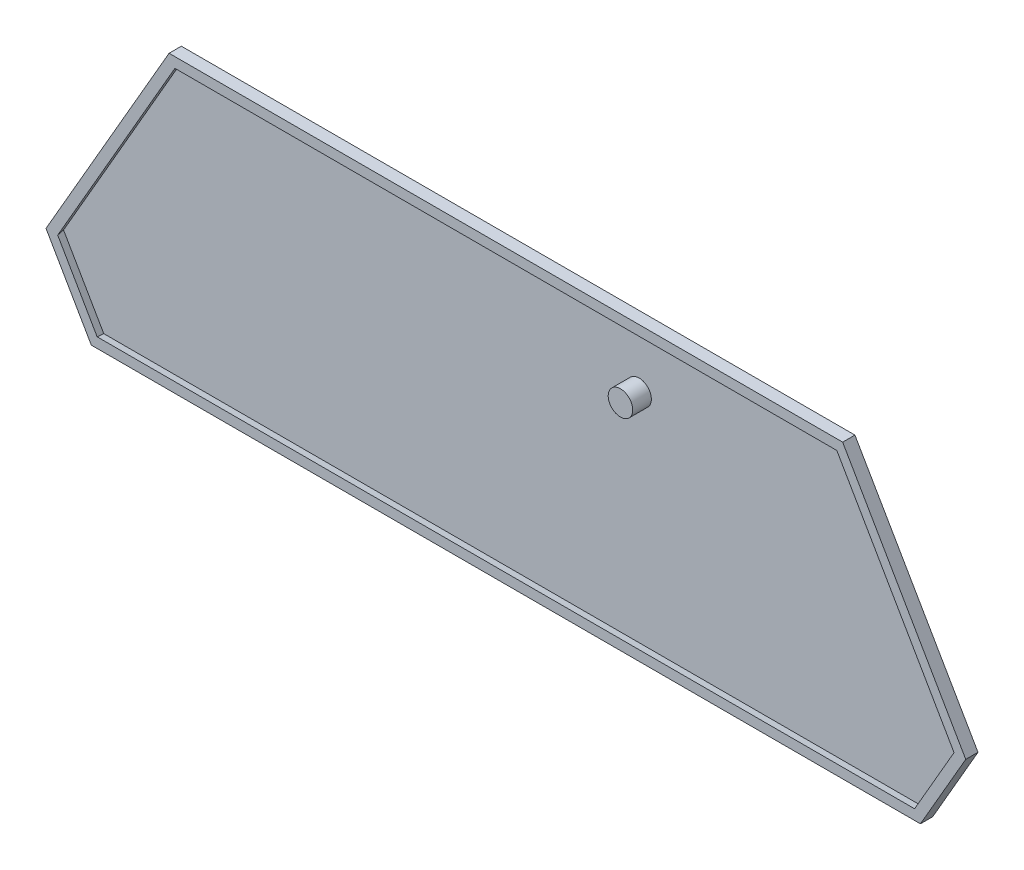
ISO-10303-21;
HEADER;
FILE_DESCRIPTION(('STEP AP214'),'2;1');
FILE_NAME('part.step','',(''),(''),'','','');
FILE_SCHEMA(('AUTOMOTIVE_DESIGN { 1 0 10303 214 1 1 1 1 }'));
ENDSEC;
DATA;
#1=APPLICATION_CONTEXT('core data for automotive mechanical design processes');
#2=APPLICATION_PROTOCOL_DEFINITION('international standard','automotive_design',2000,#1);
#3=PRODUCT_CONTEXT('',#1,'mechanical');
#4=PRODUCT('Part','Part','',(#3));
#5=PRODUCT_RELATED_PRODUCT_CATEGORY('part','',(#4));
#6=PRODUCT_DEFINITION_FORMATION('','',#4);
#7=PRODUCT_DEFINITION_CONTEXT('part definition',#1,'design');
#8=PRODUCT_DEFINITION('design','',#6,#7);
#9=PRODUCT_DEFINITION_SHAPE('','',#8);
#10=(LENGTH_UNIT() NAMED_UNIT(*) SI_UNIT(.MILLI.,.METRE.));
#11=(NAMED_UNIT(*) PLANE_ANGLE_UNIT() SI_UNIT($,.RADIAN.));
#12=(NAMED_UNIT(*) SI_UNIT($,.STERADIAN.) SOLID_ANGLE_UNIT());
#13=UNCERTAINTY_MEASURE_WITH_UNIT(LENGTH_MEASURE(1.E-05),#10,'distance_accuracy_value','');
#14=(GEOMETRIC_REPRESENTATION_CONTEXT(3) GLOBAL_UNCERTAINTY_ASSIGNED_CONTEXT((#13)) GLOBAL_UNIT_ASSIGNED_CONTEXT((#10,
#11,#12)) REPRESENTATION_CONTEXT('',''));
#15=CARTESIAN_POINT('',(0.,0.,0.));
#16=DIRECTION('',(0.,0.,1.));
#17=DIRECTION('',(1.,0.,0.));
#18=AXIS2_PLACEMENT_3D('',#15,#16,#17);
#19=CARTESIAN_POINT('',(0.,0.,2.5));
#20=DIRECTION('',(0.,0.,1.));
#21=DIRECTION('',(1.,0.,0.));
#22=AXIS2_PLACEMENT_3D('',#19,#20,#21);
#23=PLANE('',#22);
#24=DIRECTION('',(0.5,-0.866025403784439,0.));
#25=VECTOR('',#24,1.);
#26=CARTESIAN_POINT('',(-91.9744944991548,-42.4348324910002,2.5));
#27=LINE('',#26,#25);
#28=CARTESIAN_POINT('',(-91.378527434551,-43.4670777265315,2.5));
#29=VERTEX_POINT('',#28);
#30=CARTESIAN_POINT('',(-83.3328572567245,-57.4025872554689,2.5));
#31=VERTEX_POINT('',#30);
#32=EDGE_CURVE('E259',#29,#31,#27,.T.);
#33=ORIENTED_EDGE('',*,*,#32,.F.);
#34=DIRECTION('',(-0.5,-0.866025403784439,0.));
#35=VECTOR('',#34,1.);
#36=CARTESIAN_POINT('',(-66.8787654728554,-1.0322452355313,2.5));
#37=LINE('',#36,#35);
#38=CARTESIAN_POINT('',(-67.4747325374591,-2.06449047106265,2.5));
#39=VERTEX_POINT('',#38);
#40=EDGE_CURVE('E237',#39,#29,#37,.T.);
#41=ORIENTED_EDGE('',*,*,#40,.F.);
#42=DIRECTION('',(-1.,0.,0.));
#43=VECTOR('',#42,1.);
#44=CARTESIAN_POINT('',(68.6666666666666,-2.06449047106265,2.5));
#45=LINE('',#44,#43);
#46=CARTESIAN_POINT('',(67.4747325374592,-2.06449047106265,2.5));
#47=VERTEX_POINT('',#46);
#48=EDGE_CURVE('E242',#47,#39,#45,.T.);
#49=ORIENTED_EDGE('',*,*,#48,.F.);
#50=DIRECTION('',(-0.5,0.866025403784438,0.));
#51=VECTOR('',#50,1.);
#52=CARTESIAN_POINT('',(91.9744944991548,-44.4993229620628,2.5));
#53=LINE('',#52,#51);
#54=CARTESIAN_POINT('',(91.3785274345511,-43.4670777265315,2.5));
#55=VERTEX_POINT('',#54);
#56=EDGE_CURVE('E261',#55,#47,#53,.T.);
#57=ORIENTED_EDGE('',*,*,#56,.F.);
#58=DIRECTION('',(0.5,0.866025403784439,0.));
#59=VECTOR('',#58,1.);
#60=CARTESIAN_POINT('',(82.7368901921208,-58.4348324910002,2.5));
#61=LINE('',#60,#59);
#62=CARTESIAN_POINT('',(83.3328572567245,-57.4025872554688,2.5));
#63=VERTEX_POINT('',#62);
#64=EDGE_CURVE('E264',#63,#55,#61,.T.);
#65=ORIENTED_EDGE('',*,*,#64,.F.);
#66=DIRECTION('',(1.,0.,0.));
#67=VECTOR('',#66,1.);
#68=CARTESIAN_POINT('',(-84.5247913859319,-57.4025872554689,2.5));
#69=LINE('',#68,#67);
#70=EDGE_CURVE('E266',#31,#63,#69,.T.);
#71=ORIENTED_EDGE('',*,*,#70,.F.);
#72=EDGE_LOOP('',(#33,#41,#49,#57,#65,#71));
#73=FACE_BOUND('',#72,.T.);
#74=DIRECTION('',(-0.5,0.866025403784439,0.));
#75=VECTOR('',#74,1.);
#76=CARTESIAN_POINT('',(-84.5247913859319,-59.4670777265316,2.5));
#77=LINE('',#76,#75);
#78=CARTESIAN_POINT('',(-84.5247913859319,-59.4670777265316,2.5));
#79=VERTEX_POINT('',#78);
#80=CARTESIAN_POINT('',(-93.762395692966,-43.4670777265315,2.5));
#81=VERTEX_POINT('',#80);
#82=EDGE_CURVE('E214',#79,#81,#77,.T.);
#83=ORIENTED_EDGE('',*,*,#82,.F.);
#84=DIRECTION('',(-1.,0.,0.));
#85=VECTOR('',#84,1.);
#86=CARTESIAN_POINT('',(84.524791385932,-59.4670777265315,2.5));
#87=LINE('',#86,#85);
#88=CARTESIAN_POINT('',(84.524791385932,-59.4670777265315,2.5));
#89=VERTEX_POINT('',#88);
#90=EDGE_CURVE('E295',#89,#79,#87,.T.);
#91=ORIENTED_EDGE('',*,*,#90,.F.);
#92=DIRECTION('',(-0.5,-0.866025403784439,0.));
#93=VECTOR('',#92,1.);
#94=CARTESIAN_POINT('',(93.762395692966,-43.4670777265315,2.5));
#95=LINE('',#94,#93);
#96=CARTESIAN_POINT('',(93.762395692966,-43.4670777265315,2.5));
#97=VERTEX_POINT('',#96);
#98=EDGE_CURVE('E220',#97,#89,#95,.T.);
#99=ORIENTED_EDGE('',*,*,#98,.F.);
#100=DIRECTION('',(0.5,-0.866025403784438,0.));
#101=VECTOR('',#100,1.);
#102=CARTESIAN_POINT('',(68.6666666666666,0.,2.5));
#103=LINE('',#102,#101);
#104=CARTESIAN_POINT('',(68.6666666666666,0.,2.5));
#105=VERTEX_POINT('',#104);
#106=EDGE_CURVE('E218',#105,#97,#103,.T.);
#107=ORIENTED_EDGE('',*,*,#106,.F.);
#108=DIRECTION('',(1.,0.,0.));
#109=VECTOR('',#108,1.);
#110=CARTESIAN_POINT('',(-68.6666666666666,0.,2.5));
#111=LINE('',#110,#109);
#112=CARTESIAN_POINT('',(-68.6666666666666,0.,2.5));
#113=VERTEX_POINT('',#112);
#114=EDGE_CURVE('E199',#113,#105,#111,.T.);
#115=ORIENTED_EDGE('',*,*,#114,.F.);
#116=DIRECTION('',(0.5,0.866025403784439,0.));
#117=VECTOR('',#116,1.);
#118=CARTESIAN_POINT('',(-93.762395692966,-43.4670777265315,2.5));
#119=LINE('',#118,#117);
#120=EDGE_CURVE('E209',#81,#113,#119,.T.);
#121=ORIENTED_EDGE('',*,*,#120,.F.);
#122=EDGE_LOOP('',(#83,#91,#99,#107,#115,#121));
#123=FACE_BOUND('',#122,.T.);
#124=ADVANCED_FACE('F105',(#73,#123),#23,.T.);
#125=CARTESIAN_POINT('',(-67.1078209398546,-0.899999999999948,1.));
#126=DIRECTION('',(0.852868531952443,-0.492403876506104,-0.173648177666931));
#127=DIRECTION('',(0.5,0.866025403784439,0.));
#128=AXIS2_PLACEMENT_3D('',#125,#126,#127);
#129=PLANE('',#128);
#130=DIRECTION('',(-0.5,-0.866025403784439,0.));
#131=VECTOR('',#130,1.);
#132=CARTESIAN_POINT('',(-67.1078209398546,-0.899999999999948,1.));
#133=LINE('',#132,#131);
#134=CARTESIAN_POINT('',(-67.6274361821253,-1.79999999999995,1.));
#135=VERTEX_POINT('',#134);
#136=CARTESIAN_POINT('',(-91.6839347238833,-43.4670777265315,1.));
#137=VERTEX_POINT('',#136);
#138=EDGE_CURVE('E126',#135,#137,#133,.T.);
#139=ORIENTED_EDGE('',*,*,#138,.F.);
#140=DIRECTION('',(-0.099755741639432,0.17278201286621,-0.97989548832509));
#141=VECTOR('',#140,1.);
#142=CARTESIAN_POINT('',(-67.6377777808265,-1.78208782561789,0.898415011077203));
#143=LINE('',#142,#141);
#144=EDGE_CURVE('E238',#39,#135,#143,.T.);
#145=ORIENTED_EDGE('',*,*,#144,.F.);
#146=ORIENTED_EDGE('',*,*,#40,.T.);
#147=DIRECTION('',(-0.199511483278864,0.,-0.979895488325091));
#148=VECTOR('',#147,1.);
#149=CARTESIAN_POINT('',(-91.7046179212858,-43.4670777265315,0.898415011077203));
#150=LINE('',#149,#148);
#151=EDGE_CURVE('E243',#29,#137,#150,.T.);
#152=ORIENTED_EDGE('',*,*,#151,.T.);
#153=EDGE_LOOP('',(#139,#145,#146,#152));
#154=FACE_BOUND('',#153,.T.);
#155=ADVANCED_FACE('F320',(#154),#129,.T.);
#156=CARTESIAN_POINT('',(-92.203549966154,-42.5670777265315,1.));
#157=DIRECTION('',(0.852868531952443,0.492403876506104,-0.173648177666931));
#158=DIRECTION('',(-0.5,0.866025403784439,0.));
#159=AXIS2_PLACEMENT_3D('',#156,#157,#158);
#160=PLANE('',#159);
#161=DIRECTION('',(0.5,-0.866025403784439,0.));
#162=VECTOR('',#161,1.);
#163=CARTESIAN_POINT('',(-92.203549966154,-42.5670777265315,1.));
#164=LINE('',#163,#162);
#165=CARTESIAN_POINT('',(-83.4855609013906,-57.6670777265316,1.));
#166=VERTEX_POINT('',#165);
#167=EDGE_CURVE('E227',#137,#166,#164,.T.);
#168=ORIENTED_EDGE('',*,*,#167,.F.);
#169=ORIENTED_EDGE('',*,*,#151,.F.);
#170=ORIENTED_EDGE('',*,*,#32,.T.);
#171=DIRECTION('',(-0.099755741639432,-0.172782012866211,-0.979895488325091));
#172=VECTOR('',#171,1.);
#173=CARTESIAN_POINT('',(-83.4959025000919,-57.6849899009136,0.898415011077204));
#174=LINE('',#173,#172);
#175=EDGE_CURVE('E247',#31,#166,#174,.T.);
#176=ORIENTED_EDGE('',*,*,#175,.T.);
#177=EDGE_LOOP('',(#168,#169,#170,#176));
#178=FACE_BOUND('',#177,.T.);
#179=ADVANCED_FACE('F326',(#178),#160,.T.);
#180=CARTESIAN_POINT('',(-84.5247913859319,-57.6670777265316,1.));
#181=DIRECTION('',(0.,0.984807753012208,-0.173648177666931));
#182=DIRECTION('',(0.,0.173648177666931,0.984807753012208));
#183=AXIS2_PLACEMENT_3D('',#180,#181,#182);
#184=PLANE('',#183);
#185=DIRECTION('',(1.,0.,0.));
#186=VECTOR('',#185,1.);
#187=CARTESIAN_POINT('',(-84.5247913859319,-57.6670777265316,1.));
#188=LINE('',#187,#186);
#189=CARTESIAN_POINT('',(83.4855609013907,-57.6670777265315,1.));
#190=VERTEX_POINT('',#189);
#191=EDGE_CURVE('E229',#166,#190,#188,.T.);
#192=ORIENTED_EDGE('',*,*,#191,.F.);
#193=ORIENTED_EDGE('',*,*,#175,.F.);
#194=ORIENTED_EDGE('',*,*,#70,.T.);
#195=DIRECTION('',(0.099755741639432,-0.17278201286621,-0.97989548832509));
#196=VECTOR('',#195,1.);
#197=CARTESIAN_POINT('',(83.4959025000919,-57.6849899009135,0.898415011077203));
#198=LINE('',#197,#196);
#199=EDGE_CURVE('E250',#63,#190,#198,.T.);
#200=ORIENTED_EDGE('',*,*,#199,.T.);
#201=EDGE_LOOP('',(#192,#193,#194,#200));
#202=FACE_BOUND('',#201,.T.);
#203=ADVANCED_FACE('F335',(#202),#184,.T.);
#204=CARTESIAN_POINT('',(82.96594565912,-58.5670777265315,1.));
#205=DIRECTION('',(-0.852868531952443,0.492403876506104,-0.173648177666931));
#206=DIRECTION('',(-0.5,-0.866025403784439,0.));
#207=AXIS2_PLACEMENT_3D('',#204,#205,#206);
#208=PLANE('',#207);
#209=DIRECTION('',(0.5,0.866025403784439,0.));
#210=VECTOR('',#209,1.);
#211=CARTESIAN_POINT('',(82.96594565912,-58.5670777265315,1.));
#212=LINE('',#211,#210);
#213=CARTESIAN_POINT('',(91.6839347238834,-43.4670777265315,1.));
#214=VERTEX_POINT('',#213);
#215=EDGE_CURVE('E231',#190,#214,#212,.T.);
#216=ORIENTED_EDGE('',*,*,#215,.F.);
#217=ORIENTED_EDGE('',*,*,#199,.F.);
#218=ORIENTED_EDGE('',*,*,#64,.T.);
#219=DIRECTION('',(0.199511483278864,0.,-0.97989548832509));
#220=VECTOR('',#219,1.);
#221=CARTESIAN_POINT('',(91.7046179212859,-43.4670777265315,0.898415011077204));
#222=LINE('',#221,#220);
#223=EDGE_CURVE('E253',#55,#214,#222,.T.);
#224=ORIENTED_EDGE('',*,*,#223,.T.);
#225=EDGE_LOOP('',(#216,#217,#218,#224));
#226=FACE_BOUND('',#225,.T.);
#227=ADVANCED_FACE('F339',(#226),#208,.T.);
#228=CARTESIAN_POINT('',(92.203549966154,-44.3670777265315,1.));
#229=DIRECTION('',(-0.852868531952443,-0.492403876506104,-0.173648177666931));
#230=DIRECTION('',(0.5,-0.866025403784438,0.));
#231=AXIS2_PLACEMENT_3D('',#228,#229,#230);
#232=PLANE('',#231);
#233=DIRECTION('',(-0.5,0.866025403784438,0.));
#234=VECTOR('',#233,1.);
#235=CARTESIAN_POINT('',(92.203549966154,-44.3670777265315,1.));
#236=LINE('',#235,#234);
#237=CARTESIAN_POINT('',(67.6274361821253,-1.79999999999995,1.));
#238=VERTEX_POINT('',#237);
#239=EDGE_CURVE('E233',#214,#238,#236,.T.);
#240=ORIENTED_EDGE('',*,*,#239,.F.);
#241=ORIENTED_EDGE('',*,*,#223,.F.);
#242=ORIENTED_EDGE('',*,*,#56,.T.);
#243=DIRECTION('',(0.0997557416394319,0.17278201286621,-0.97989548832509));
#244=VECTOR('',#243,1.);
#245=CARTESIAN_POINT('',(67.6377777808266,-1.78208782561789,0.898415011077204));
#246=LINE('',#245,#244);
#247=EDGE_CURVE('E241',#47,#238,#246,.T.);
#248=ORIENTED_EDGE('',*,*,#247,.T.);
#249=EDGE_LOOP('',(#240,#241,#242,#248));
#250=FACE_BOUND('',#249,.T.);
#251=ADVANCED_FACE('F316',(#250),#232,.T.);
#252=CARTESIAN_POINT('',(68.6666666666666,-1.79999999999995,1.));
#253=DIRECTION('',(0.,-0.984807753012208,-0.173648177666931));
#254=DIRECTION('',(0.,0.173648177666931,-0.984807753012208));
#255=AXIS2_PLACEMENT_3D('',#252,#253,#254);
#256=PLANE('',#255);
#257=DIRECTION('',(-1.,0.,0.));
#258=VECTOR('',#257,1.);
#259=CARTESIAN_POINT('',(68.6666666666666,-1.79999999999995,1.));
#260=LINE('',#259,#258);
#261=EDGE_CURVE('E235',#238,#135,#260,.T.);
#262=ORIENTED_EDGE('',*,*,#261,.F.);
#263=ORIENTED_EDGE('',*,*,#247,.F.);
#264=ORIENTED_EDGE('',*,*,#48,.T.);
#265=ORIENTED_EDGE('',*,*,#144,.T.);
#266=EDGE_LOOP('',(#262,#263,#264,#265));
#267=FACE_BOUND('',#266,.T.);
#268=ADVANCED_FACE('F309',(#267),#256,.T.);
#269=CARTESIAN_POINT('',(0.,0.,1.));
#270=DIRECTION('',(0.,0.,1.));
#271=DIRECTION('',(1.,0.,0.));
#272=AXIS2_PLACEMENT_3D('',#269,#270,#271);
#273=PLANE('',#272);
#274=CARTESIAN_POINT('',(25.665479370752,-13.4245413062782,1.));
#275=DIRECTION('',(0.,0.,1.));
#276=DIRECTION('',(1.,0.,0.));
#277=AXIS2_PLACEMENT_3D('',#274,#275,#276);
#278=CIRCLE('',#277,2.5);
#279=CARTESIAN_POINT('',(28.165479370752,-13.4245413062782,1.));
#280=VERTEX_POINT('',#279);
#281=EDGE_CURVE('E299',#280,#280,#278,.T.);
#282=ORIENTED_EDGE('',*,*,#281,.F.);
#283=EDGE_LOOP('',(#282));
#284=FACE_BOUND('',#283,.T.);
#285=ORIENTED_EDGE('',*,*,#138,.T.);
#286=ORIENTED_EDGE('',*,*,#167,.T.);
#287=ORIENTED_EDGE('',*,*,#191,.T.);
#288=ORIENTED_EDGE('',*,*,#215,.T.);
#289=ORIENTED_EDGE('',*,*,#239,.T.);
#290=ORIENTED_EDGE('',*,*,#261,.T.);
#291=EDGE_LOOP('',(#285,#286,#287,#288,#289,#290));
#292=FACE_BOUND('',#291,.T.);
#293=ADVANCED_FACE('F307',(#284,#292),#273,.T.);
#294=CARTESIAN_POINT('',(0.,0.,0.));
#295=DIRECTION('',(0.,0.,1.));
#296=DIRECTION('',(1.,0.,0.));
#297=AXIS2_PLACEMENT_3D('',#294,#295,#296);
#298=PLANE('',#297);
#299=DIRECTION('',(0.5,-0.866025403784439,0.));
#300=VECTOR('',#299,1.);
#301=CARTESIAN_POINT('',(-93.762395692966,-43.4670777265315,0.));
#302=LINE('',#301,#300);
#303=CARTESIAN_POINT('',(-93.762395692966,-43.4670777265315,0.));
#304=VERTEX_POINT('',#303);
#305=CARTESIAN_POINT('',(-84.5247913859319,-59.4670777265316,0.));
#306=VERTEX_POINT('',#305);
#307=EDGE_CURVE('E246',#304,#306,#302,.T.);
#308=ORIENTED_EDGE('',*,*,#307,.F.);
#309=DIRECTION('',(-0.5,-0.866025403784439,0.));
#310=VECTOR('',#309,1.);
#311=CARTESIAN_POINT('',(-68.6666666666666,0.,0.));
#312=LINE('',#311,#310);
#313=CARTESIAN_POINT('',(-68.6666666666666,0.,0.));
#314=VERTEX_POINT('',#313);
#315=EDGE_CURVE('E277',#314,#304,#312,.T.);
#316=ORIENTED_EDGE('',*,*,#315,.F.);
#317=DIRECTION('',(-1.,0.,0.));
#318=VECTOR('',#317,1.);
#319=CARTESIAN_POINT('',(68.6666666666666,0.,0.));
#320=LINE('',#319,#318);
#321=CARTESIAN_POINT('',(68.6666666666666,0.,0.));
#322=VERTEX_POINT('',#321);
#323=EDGE_CURVE('E202',#322,#314,#320,.T.);
#324=ORIENTED_EDGE('',*,*,#323,.F.);
#325=DIRECTION('',(-0.5,0.866025403784438,0.));
#326=VECTOR('',#325,1.);
#327=CARTESIAN_POINT('',(93.762395692966,-43.4670777265315,0.));
#328=LINE('',#327,#326);
#329=CARTESIAN_POINT('',(93.762395692966,-43.4670777265315,0.));
#330=VERTEX_POINT('',#329);
#331=EDGE_CURVE('E274',#330,#322,#328,.T.);
#332=ORIENTED_EDGE('',*,*,#331,.F.);
#333=DIRECTION('',(0.5,0.866025403784439,0.));
#334=VECTOR('',#333,1.);
#335=CARTESIAN_POINT('',(84.524791385932,-59.4670777265315,0.));
#336=LINE('',#335,#334);
#337=CARTESIAN_POINT('',(84.524791385932,-59.4670777265315,0.));
#338=VERTEX_POINT('',#337);
#339=EDGE_CURVE('E272',#338,#330,#336,.T.);
#340=ORIENTED_EDGE('',*,*,#339,.F.);
#341=DIRECTION('',(1.,0.,0.));
#342=VECTOR('',#341,1.);
#343=CARTESIAN_POINT('',(2.70000000000004,-59.4670777265316,0.));
#344=LINE('',#343,#342);
#345=EDGE_CURVE('E270',#306,#338,#344,.T.);
#346=ORIENTED_EDGE('',*,*,#345,.F.);
#347=EDGE_LOOP('',(#308,#316,#324,#332,#340,#346));
#348=FACE_BOUND('',#347,.T.);
#349=ADVANCED_FACE('F292',(#348),#298,.F.);
#350=CARTESIAN_POINT('',(68.6666666666666,0.,1.));
#351=DIRECTION('',(0.,-1.,0.));
#352=DIRECTION('',(0.,0.,-1.));
#353=AXIS2_PLACEMENT_3D('',#350,#351,#352);
#354=PLANE('',#353);
#355=ORIENTED_EDGE('',*,*,#323,.T.);
#356=DIRECTION('',(0.,0.,-1.));
#357=VECTOR('',#356,1.);
#358=CARTESIAN_POINT('',(-68.6666666666666,0.,1.));
#359=LINE('',#358,#357);
#360=EDGE_CURVE('E194',#113,#314,#359,.T.);
#361=ORIENTED_EDGE('',*,*,#360,.F.);
#362=ORIENTED_EDGE('',*,*,#114,.T.);
#363=DIRECTION('',(0.,0.,-1.));
#364=VECTOR('',#363,1.);
#365=CARTESIAN_POINT('',(68.6666666666666,0.,1.));
#366=LINE('',#365,#364);
#367=EDGE_CURVE('E205',#105,#322,#366,.T.);
#368=ORIENTED_EDGE('',*,*,#367,.T.);
#369=EDGE_LOOP('',(#355,#361,#362,#368));
#370=FACE_BOUND('',#369,.T.);
#371=ADVANCED_FACE('F196',(#370),#354,.F.);
#372=CARTESIAN_POINT('',(93.762395692966,-43.4670777265315,1.));
#373=DIRECTION('',(-0.866025403784439,-0.5,0.));
#374=DIRECTION('',(0.5,-0.866025403784438,0.));
#375=AXIS2_PLACEMENT_3D('',#372,#373,#374);
#376=PLANE('',#375);
#377=ORIENTED_EDGE('',*,*,#331,.T.);
#378=ORIENTED_EDGE('',*,*,#367,.F.);
#379=ORIENTED_EDGE('',*,*,#106,.T.);
#380=DIRECTION('',(0.,0.,-1.));
#381=VECTOR('',#380,1.);
#382=CARTESIAN_POINT('',(93.762395692966,-43.4670777265315,1.));
#383=LINE('',#382,#381);
#384=EDGE_CURVE('E281',#97,#330,#383,.T.);
#385=ORIENTED_EDGE('',*,*,#384,.T.);
#386=EDGE_LOOP('',(#377,#378,#379,#385));
#387=FACE_BOUND('',#386,.T.);
#388=ADVANCED_FACE('F294',(#387),#376,.F.);
#389=CARTESIAN_POINT('',(84.524791385932,-59.4670777265315,1.));
#390=DIRECTION('',(-0.866025403784439,0.5,0.));
#391=DIRECTION('',(-0.5,-0.866025403784439,0.));
#392=AXIS2_PLACEMENT_3D('',#389,#390,#391);
#393=PLANE('',#392);
#394=ORIENTED_EDGE('',*,*,#339,.T.);
#395=ORIENTED_EDGE('',*,*,#384,.F.);
#396=ORIENTED_EDGE('',*,*,#98,.T.);
#397=DIRECTION('',(0.,0.,-1.));
#398=VECTOR('',#397,1.);
#399=CARTESIAN_POINT('',(84.524791385932,-59.4670777265315,1.));
#400=LINE('',#399,#398);
#401=EDGE_CURVE('E113',#89,#338,#400,.T.);
#402=ORIENTED_EDGE('',*,*,#401,.T.);
#403=EDGE_LOOP('',(#394,#395,#396,#402));
#404=FACE_BOUND('',#403,.T.);
#405=ADVANCED_FACE('F286',(#404),#393,.F.);
#406=CARTESIAN_POINT('',(2.70000000000004,-59.4670777265316,1.));
#407=DIRECTION('',(0.,1.,0.));
#408=DIRECTION('',(-1.,0.,0.));
#409=AXIS2_PLACEMENT_3D('',#406,#407,#408);
#410=PLANE('',#409);
#411=ORIENTED_EDGE('',*,*,#345,.T.);
#412=ORIENTED_EDGE('',*,*,#401,.F.);
#413=ORIENTED_EDGE('',*,*,#90,.T.);
#414=DIRECTION('',(0.,0.,-1.));
#415=VECTOR('',#414,1.);
#416=CARTESIAN_POINT('',(-84.5247913859319,-59.4670777265316,1.));
#417=LINE('',#416,#415);
#418=EDGE_CURVE('E12',#79,#306,#417,.T.);
#419=ORIENTED_EDGE('',*,*,#418,.T.);
#420=EDGE_LOOP('',(#411,#412,#413,#419));
#421=FACE_BOUND('',#420,.T.);
#422=ADVANCED_FACE('F399',(#421),#410,.F.);
#423=CARTESIAN_POINT('',(-93.762395692966,-43.4670777265315,1.));
#424=DIRECTION('',(0.866025403784439,0.5,0.));
#425=DIRECTION('',(-0.5,0.866025403784439,0.));
#426=AXIS2_PLACEMENT_3D('',#423,#424,#425);
#427=PLANE('',#426);
#428=ORIENTED_EDGE('',*,*,#307,.T.);
#429=ORIENTED_EDGE('',*,*,#418,.F.);
#430=ORIENTED_EDGE('',*,*,#82,.T.);
#431=DIRECTION('',(0.,0.,-1.));
#432=VECTOR('',#431,1.);
#433=CARTESIAN_POINT('',(-93.762395692966,-43.4670777265315,1.));
#434=LINE('',#433,#432);
#435=EDGE_CURVE('E206',#81,#304,#434,.T.);
#436=ORIENTED_EDGE('',*,*,#435,.T.);
#437=EDGE_LOOP('',(#428,#429,#430,#436));
#438=FACE_BOUND('',#437,.T.);
#439=ADVANCED_FACE('F107',(#438),#427,.F.);
#440=CARTESIAN_POINT('',(-68.6666666666666,0.,1.));
#441=DIRECTION('',(0.866025403784439,-0.5,0.));
#442=DIRECTION('',(0.5,0.866025403784439,0.));
#443=AXIS2_PLACEMENT_3D('',#440,#441,#442);
#444=PLANE('',#443);
#445=ORIENTED_EDGE('',*,*,#315,.T.);
#446=ORIENTED_EDGE('',*,*,#435,.F.);
#447=ORIENTED_EDGE('',*,*,#120,.T.);
#448=ORIENTED_EDGE('',*,*,#360,.T.);
#449=EDGE_LOOP('',(#445,#446,#447,#448));
#450=FACE_BOUND('',#449,.T.);
#451=ADVANCED_FACE('F210',(#450),#444,.F.);
#452=CARTESIAN_POINT('',(25.665479370752,-13.4245413062782,4.8));
#453=DIRECTION('',(0.,0.,-1.));
#454=DIRECTION('',(-1.,0.,0.));
#455=AXIS2_PLACEMENT_3D('',#452,#453,#454);
#456=CYLINDRICAL_SURFACE('',#455,2.5);
#457=CARTESIAN_POINT('',(25.665479370752,-13.4245413062782,4.8));
#458=DIRECTION('',(0.,0.,1.));
#459=DIRECTION('',(1.,0.,0.));
#460=AXIS2_PLACEMENT_3D('',#457,#458,#459);
#461=CIRCLE('',#460,2.5);
#462=CARTESIAN_POINT('',(28.165479370752,-13.4245413062782,4.8));
#463=VERTEX_POINT('',#462);
#464=EDGE_CURVE('E296',#463,#463,#461,.T.);
#465=ORIENTED_EDGE('',*,*,#464,.F.);
#466=EDGE_LOOP('',(#465));
#467=FACE_BOUND('',#466,.T.);
#468=ORIENTED_EDGE('',*,*,#281,.T.);
#469=EDGE_LOOP('',(#468));
#470=FACE_BOUND('',#469,.T.);
#471=ADVANCED_FACE('F305',(#467,#470),#456,.T.);
#472=CARTESIAN_POINT('',(25.665479370752,-13.4245413062782,4.8));
#473=DIRECTION('',(0.,0.,1.));
#474=DIRECTION('',(1.,0.,0.));
#475=AXIS2_PLACEMENT_3D('',#472,#473,#474);
#476=PLANE('',#475);
#477=ORIENTED_EDGE('',*,*,#464,.T.);
#478=EDGE_LOOP('',(#477));
#479=FACE_BOUND('',#478,.T.);
#480=ADVANCED_FACE('F439',(#479),#476,.T.);
#481=CLOSED_SHELL('',(#124,#155,#179,#203,#227,#251,#268,#293,#349,#371,#388,#405,#422,#439,
#451,#471,#480));
#482=MANIFOLD_SOLID_BREP('B2',#481);
#483=ADVANCED_BREP_SHAPE_REPRESENTATION('',(#18,#482),#14);
#484=SHAPE_DEFINITION_REPRESENTATION(#9,#483);
ENDSEC;
END-ISO-10303-21;
